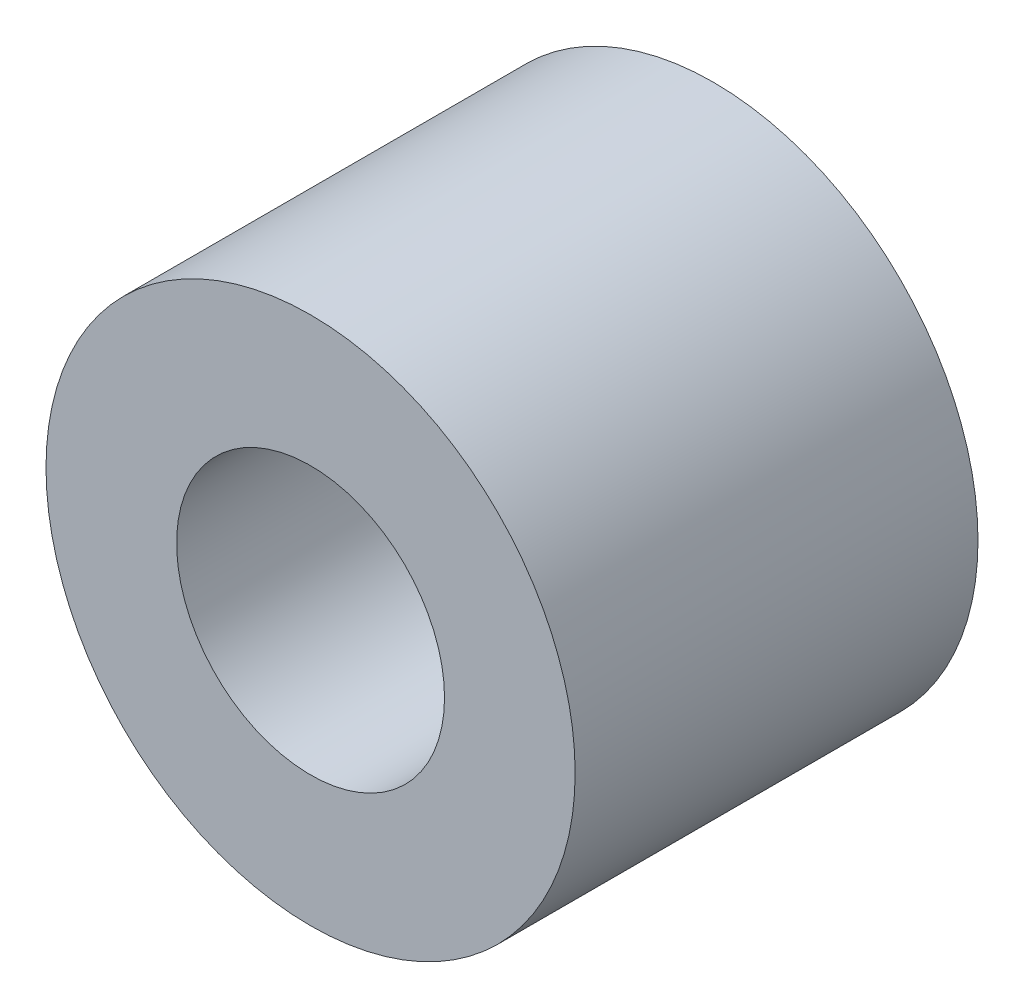
ISO-10303-21;
HEADER;
FILE_DESCRIPTION(('STEP AP214'),'2;1');
FILE_NAME('part.step','',(''),(''),'','','');
FILE_SCHEMA(('AUTOMOTIVE_DESIGN { 1 0 10303 214 1 1 1 1 }'));
ENDSEC;
DATA;
#1=APPLICATION_CONTEXT('core data for automotive mechanical design processes');
#2=APPLICATION_PROTOCOL_DEFINITION('international standard','automotive_design',2000,#1);
#3=PRODUCT_CONTEXT('',#1,'mechanical');
#4=PRODUCT('Part','Part','',(#3));
#5=PRODUCT_RELATED_PRODUCT_CATEGORY('part','',(#4));
#6=PRODUCT_DEFINITION_FORMATION('','',#4);
#7=PRODUCT_DEFINITION_CONTEXT('part definition',#1,'design');
#8=PRODUCT_DEFINITION('design','',#6,#7);
#9=PRODUCT_DEFINITION_SHAPE('','',#8);
#10=(LENGTH_UNIT() NAMED_UNIT(*) SI_UNIT(.MILLI.,.METRE.));
#11=(NAMED_UNIT(*) PLANE_ANGLE_UNIT() SI_UNIT($,.RADIAN.));
#12=(NAMED_UNIT(*) SI_UNIT($,.STERADIAN.) SOLID_ANGLE_UNIT());
#13=UNCERTAINTY_MEASURE_WITH_UNIT(LENGTH_MEASURE(1.E-05),#10,'distance_accuracy_value','');
#14=(GEOMETRIC_REPRESENTATION_CONTEXT(3) GLOBAL_UNCERTAINTY_ASSIGNED_CONTEXT((#13)) GLOBAL_UNIT_ASSIGNED_CONTEXT((#10,
#11,#12)) REPRESENTATION_CONTEXT('',''));
#15=CARTESIAN_POINT('',(0.,0.,0.));
#16=DIRECTION('',(0.,0.,1.));
#17=DIRECTION('',(1.,0.,0.));
#18=AXIS2_PLACEMENT_3D('',#15,#16,#17);
#19=CARTESIAN_POINT('',(0.,0.,2.855));
#20=DIRECTION('',(0.,0.,-1.));
#21=DIRECTION('',(-1.,0.,0.));
#22=AXIS2_PLACEMENT_3D('',#19,#20,#21);
#23=CYLINDRICAL_SURFACE('',#22,3.75);
#24=CARTESIAN_POINT('',(0.,0.,2.855));
#25=DIRECTION('',(0.,0.,1.));
#26=DIRECTION('',(1.,0.,0.));
#27=AXIS2_PLACEMENT_3D('',#24,#25,#26);
#28=CIRCLE('',#27,3.75);
#29=CARTESIAN_POINT('',(3.75,0.,2.855));
#30=VERTEX_POINT('',#29);
#31=EDGE_CURVE('E10',#30,#30,#28,.T.);
#32=ORIENTED_EDGE('',*,*,#31,.F.);
#33=EDGE_LOOP('',(#32));
#34=FACE_BOUND('',#33,.T.);
#35=CARTESIAN_POINT('',(0.,0.,-2.855));
#36=DIRECTION('',(0.,0.,1.));
#37=DIRECTION('',(1.,0.,0.));
#38=AXIS2_PLACEMENT_3D('',#35,#36,#37);
#39=CIRCLE('',#38,3.75);
#40=CARTESIAN_POINT('',(3.75,0.,-2.855));
#41=VERTEX_POINT('',#40);
#42=EDGE_CURVE('E38',#41,#41,#39,.T.);
#43=ORIENTED_EDGE('',*,*,#42,.T.);
#44=EDGE_LOOP('',(#43));
#45=FACE_BOUND('',#44,.T.);
#46=ADVANCED_FACE('F35',(#34,#45),#23,.T.);
#47=CARTESIAN_POINT('',(0.,0.,2.855));
#48=DIRECTION('',(0.,0.,1.));
#49=DIRECTION('',(1.,0.,0.));
#50=AXIS2_PLACEMENT_3D('',#47,#48,#49);
#51=PLANE('',#50);
#52=CARTESIAN_POINT('',(0.,0.,2.855));
#53=DIRECTION('',(0.,0.,1.));
#54=DIRECTION('',(1.,0.,0.));
#55=AXIS2_PLACEMENT_3D('',#52,#53,#54);
#56=CIRCLE('',#55,1.89865);
#57=CARTESIAN_POINT('',(1.89865,0.,2.855));
#58=VERTEX_POINT('',#57);
#59=EDGE_CURVE('E49',#58,#58,#56,.T.);
#60=ORIENTED_EDGE('',*,*,#59,.F.);
#61=EDGE_LOOP('',(#60));
#62=FACE_BOUND('',#61,.T.);
#63=ORIENTED_EDGE('',*,*,#31,.T.);
#64=EDGE_LOOP('',(#63));
#65=FACE_BOUND('',#64,.T.);
#66=ADVANCED_FACE('F55',(#62,#65),#51,.T.);
#67=CARTESIAN_POINT('',(0.,0.,-2.855));
#68=DIRECTION('',(0.,0.,1.));
#69=DIRECTION('',(1.,0.,0.));
#70=AXIS2_PLACEMENT_3D('',#67,#68,#69);
#71=PLANE('',#70);
#72=CARTESIAN_POINT('',(0.,0.,-2.855));
#73=DIRECTION('',(0.,0.,1.));
#74=DIRECTION('',(1.,0.,0.));
#75=AXIS2_PLACEMENT_3D('',#72,#73,#74);
#76=CIRCLE('',#75,1.89865);
#77=CARTESIAN_POINT('',(1.89865,0.,-2.855));
#78=VERTEX_POINT('',#77);
#79=EDGE_CURVE('E45',#78,#78,#76,.T.);
#80=ORIENTED_EDGE('',*,*,#79,.T.);
#81=EDGE_LOOP('',(#80));
#82=FACE_BOUND('',#81,.T.);
#83=ORIENTED_EDGE('',*,*,#42,.F.);
#84=EDGE_LOOP('',(#83));
#85=FACE_BOUND('',#84,.T.);
#86=ADVANCED_FACE('F57',(#82,#85),#71,.F.);
#87=CARTESIAN_POINT('',(0.,0.,2.855));
#88=DIRECTION('',(0.,0.,1.));
#89=DIRECTION('',(1.,0.,0.));
#90=AXIS2_PLACEMENT_3D('',#87,#88,#89);
#91=CYLINDRICAL_SURFACE('',#90,1.89865);
#92=ORIENTED_EDGE('',*,*,#79,.F.);
#93=EDGE_LOOP('',(#92));
#94=FACE_BOUND('',#93,.T.);
#95=ORIENTED_EDGE('',*,*,#59,.T.);
#96=EDGE_LOOP('',(#95));
#97=FACE_BOUND('',#96,.T.);
#98=ADVANCED_FACE('F53',(#94,#97),#91,.F.);
#99=CLOSED_SHELL('',(#46,#66,#86,#98));
#100=MANIFOLD_SOLID_BREP('B2',#99);
#101=ADVANCED_BREP_SHAPE_REPRESENTATION('',(#18,#100),#14);
#102=SHAPE_DEFINITION_REPRESENTATION(#9,#101);
ENDSEC;
END-ISO-10303-21;
